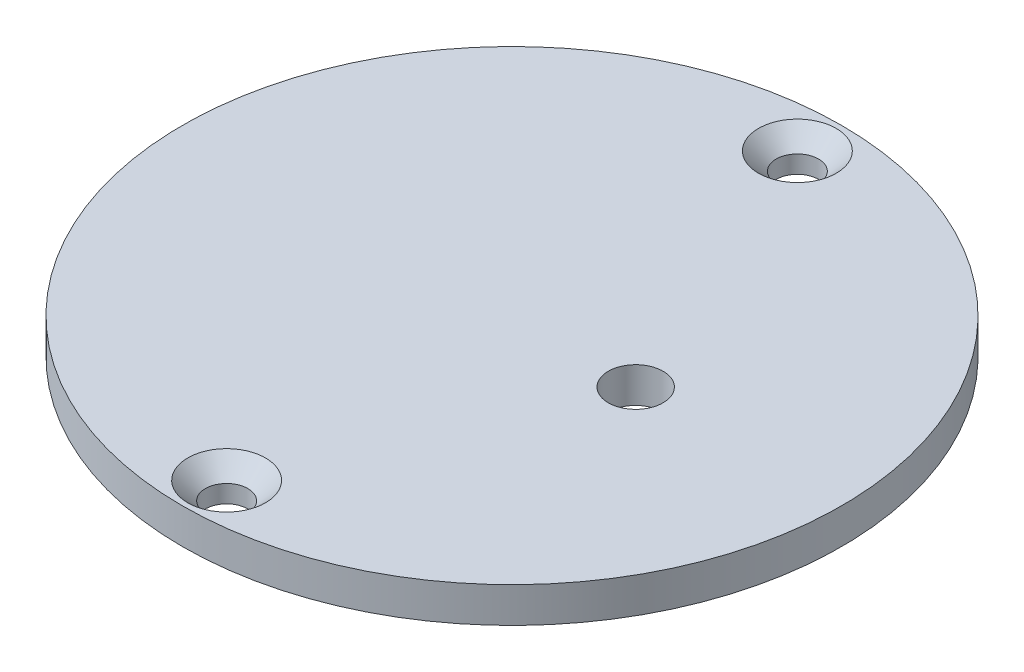
ISO-10303-21;
HEADER;
FILE_DESCRIPTION(('STEP AP214'),'2;1');
FILE_NAME('part.step','',(''),(''),'','','');
FILE_SCHEMA(('AUTOMOTIVE_DESIGN { 1 0 10303 214 1 1 1 1 }'));
ENDSEC;
DATA;
#1=APPLICATION_CONTEXT('core data for automotive mechanical design processes');
#2=APPLICATION_PROTOCOL_DEFINITION('international standard','automotive_design',2000,#1);
#3=PRODUCT_CONTEXT('',#1,'mechanical');
#4=PRODUCT('Part','Part','',(#3));
#5=PRODUCT_RELATED_PRODUCT_CATEGORY('part','',(#4));
#6=PRODUCT_DEFINITION_FORMATION('','',#4);
#7=PRODUCT_DEFINITION_CONTEXT('part definition',#1,'design');
#8=PRODUCT_DEFINITION('design','',#6,#7);
#9=PRODUCT_DEFINITION_SHAPE('','',#8);
#10=(LENGTH_UNIT() NAMED_UNIT(*) SI_UNIT(.MILLI.,.METRE.));
#11=(NAMED_UNIT(*) PLANE_ANGLE_UNIT() SI_UNIT($,.RADIAN.));
#12=(NAMED_UNIT(*) SI_UNIT($,.STERADIAN.) SOLID_ANGLE_UNIT());
#13=UNCERTAINTY_MEASURE_WITH_UNIT(LENGTH_MEASURE(1.E-05),#10,'distance_accuracy_value','');
#14=(GEOMETRIC_REPRESENTATION_CONTEXT(3) GLOBAL_UNCERTAINTY_ASSIGNED_CONTEXT((#13)) GLOBAL_UNIT_ASSIGNED_CONTEXT((#10,
#11,#12)) REPRESENTATION_CONTEXT('',''));
#15=CARTESIAN_POINT('',(0.,0.,0.));
#16=DIRECTION('',(0.,0.,1.));
#17=DIRECTION('',(1.,0.,0.));
#18=AXIS2_PLACEMENT_3D('',#15,#16,#17);
#19=CARTESIAN_POINT('',(0.,2.,0.));
#20=DIRECTION('',(0.,-1.,0.));
#21=DIRECTION('',(0.,0.,-1.));
#22=AXIS2_PLACEMENT_3D('',#19,#20,#21);
#23=CYLINDRICAL_SURFACE('',#22,18.65);
#24=CARTESIAN_POINT('',(0.,2.,0.));
#25=DIRECTION('',(0.,1.,0.));
#26=DIRECTION('',(0.,0.,1.));
#27=AXIS2_PLACEMENT_3D('',#24,#25,#26);
#28=CIRCLE('',#27,18.65);
#29=CARTESIAN_POINT('',(0.,2.,18.65));
#30=VERTEX_POINT('',#29);
#31=EDGE_CURVE('E10',#30,#30,#28,.T.);
#32=ORIENTED_EDGE('',*,*,#31,.F.);
#33=EDGE_LOOP('',(#32));
#34=FACE_BOUND('',#33,.T.);
#35=CARTESIAN_POINT('',(0.,0.,0.));
#36=DIRECTION('',(0.,1.,0.));
#37=DIRECTION('',(0.,0.,1.));
#38=AXIS2_PLACEMENT_3D('',#35,#36,#37);
#39=CIRCLE('',#38,18.65);
#40=CARTESIAN_POINT('',(0.,0.,18.65));
#41=VERTEX_POINT('',#40);
#42=EDGE_CURVE('E36',#41,#41,#39,.T.);
#43=ORIENTED_EDGE('',*,*,#42,.T.);
#44=EDGE_LOOP('',(#43));
#45=FACE_BOUND('',#44,.T.);
#46=ADVANCED_FACE('F33',(#34,#45),#23,.T.);
#47=CARTESIAN_POINT('',(0.,2.,0.));
#48=DIRECTION('',(0.,1.,0.));
#49=DIRECTION('',(0.,0.,1.));
#50=AXIS2_PLACEMENT_3D('',#47,#48,#49);
#51=PLANE('',#50);
#52=CARTESIAN_POINT('',(0.,2.,-16.15));
#53=DIRECTION('',(0.,1.,0.));
#54=DIRECTION('',(0.,0.,1.));
#55=AXIS2_PLACEMENT_3D('',#52,#53,#54);
#56=CIRCLE('',#55,2.2);
#57=CARTESIAN_POINT('',(0.,2.,-13.95));
#58=VERTEX_POINT('',#57);
#59=EDGE_CURVE('E65',#58,#58,#56,.T.);
#60=ORIENTED_EDGE('',*,*,#59,.F.);
#61=EDGE_LOOP('',(#60));
#62=FACE_BOUND('',#61,.T.);
#63=CARTESIAN_POINT('',(0.,2.,16.15));
#64=DIRECTION('',(0.,1.,0.));
#65=DIRECTION('',(0.,0.,1.));
#66=AXIS2_PLACEMENT_3D('',#63,#64,#65);
#67=CIRCLE('',#66,2.2);
#68=CARTESIAN_POINT('',(0.,2.,18.35));
#69=VERTEX_POINT('',#68);
#70=EDGE_CURVE('E56',#69,#69,#67,.T.);
#71=ORIENTED_EDGE('',*,*,#70,.F.);
#72=EDGE_LOOP('',(#71));
#73=FACE_BOUND('',#72,.T.);
#74=CARTESIAN_POINT('',(7.,2.,0.));
#75=DIRECTION('',(0.,1.,0.));
#76=DIRECTION('',(0.,0.,1.));
#77=AXIS2_PLACEMENT_3D('',#74,#75,#76);
#78=CIRCLE('',#77,1.55);
#79=CARTESIAN_POINT('',(7.,2.,1.55));
#80=VERTEX_POINT('',#79);
#81=EDGE_CURVE('E45',#80,#80,#78,.T.);
#82=ORIENTED_EDGE('',*,*,#81,.F.);
#83=EDGE_LOOP('',(#82));
#84=FACE_BOUND('',#83,.T.);
#85=ORIENTED_EDGE('',*,*,#31,.T.);
#86=EDGE_LOOP('',(#85));
#87=FACE_BOUND('',#86,.T.);
#88=ADVANCED_FACE('F71',(#62,#73,#84,#87),#51,.T.);
#89=CARTESIAN_POINT('',(0.,0.,0.));
#90=DIRECTION('',(0.,1.,0.));
#91=DIRECTION('',(0.,0.,1.));
#92=AXIS2_PLACEMENT_3D('',#89,#90,#91);
#93=PLANE('',#92);
#94=CARTESIAN_POINT('',(0.,0.,-16.15));
#95=DIRECTION('',(0.,1.,0.));
#96=DIRECTION('',(0.,0.,1.));
#97=AXIS2_PLACEMENT_3D('',#94,#95,#96);
#98=CIRCLE('',#97,1.2);
#99=CARTESIAN_POINT('',(0.,0.,-14.95));
#100=VERTEX_POINT('',#99);
#101=EDGE_CURVE('E59',#100,#100,#98,.T.);
#102=ORIENTED_EDGE('',*,*,#101,.T.);
#103=EDGE_LOOP('',(#102));
#104=FACE_BOUND('',#103,.T.);
#105=CARTESIAN_POINT('',(0.,0.,16.15));
#106=DIRECTION('',(0.,1.,0.));
#107=DIRECTION('',(0.,0.,1.));
#108=AXIS2_PLACEMENT_3D('',#105,#106,#107);
#109=CIRCLE('',#108,1.2);
#110=CARTESIAN_POINT('',(0.,0.,17.35));
#111=VERTEX_POINT('',#110);
#112=EDGE_CURVE('E48',#111,#111,#109,.T.);
#113=ORIENTED_EDGE('',*,*,#112,.T.);
#114=EDGE_LOOP('',(#113));
#115=FACE_BOUND('',#114,.T.);
#116=CARTESIAN_POINT('',(7.,0.,0.));
#117=DIRECTION('',(0.,1.,0.));
#118=DIRECTION('',(0.,0.,1.));
#119=AXIS2_PLACEMENT_3D('',#116,#117,#118);
#120=CIRCLE('',#119,1.55);
#121=CARTESIAN_POINT('',(7.,0.,1.55));
#122=VERTEX_POINT('',#121);
#123=EDGE_CURVE('E43',#122,#122,#120,.T.);
#124=ORIENTED_EDGE('',*,*,#123,.T.);
#125=EDGE_LOOP('',(#124));
#126=FACE_BOUND('',#125,.T.);
#127=ORIENTED_EDGE('',*,*,#42,.F.);
#128=EDGE_LOOP('',(#127));
#129=FACE_BOUND('',#128,.T.);
#130=ADVANCED_FACE('F74',(#104,#115,#126,#129),#93,.F.);
#131=CARTESIAN_POINT('',(7.,0.,0.));
#132=DIRECTION('',(0.,1.,0.));
#133=DIRECTION('',(0.,0.,1.));
#134=AXIS2_PLACEMENT_3D('',#131,#132,#133);
#135=CYLINDRICAL_SURFACE('',#134,1.55);
#136=ORIENTED_EDGE('',*,*,#123,.F.);
#137=EDGE_LOOP('',(#136));
#138=FACE_BOUND('',#137,.T.);
#139=ORIENTED_EDGE('',*,*,#81,.T.);
#140=EDGE_LOOP('',(#139));
#141=FACE_BOUND('',#140,.T.);
#142=ADVANCED_FACE('F80',(#138,#141),#135,.F.);
#143=CARTESIAN_POINT('',(0.,2.,16.15));
#144=DIRECTION('',(0.,1.,0.));
#145=DIRECTION('',(0.,0.,1.));
#146=AXIS2_PLACEMENT_3D('',#143,#144,#145);
#147=CYLINDRICAL_SURFACE('',#146,1.2);
#148=ORIENTED_EDGE('',*,*,#112,.F.);
#149=EDGE_LOOP('',(#148));
#150=FACE_BOUND('',#149,.T.);
#151=CARTESIAN_POINT('',(0.,0.999999999999999,16.15));
#152=DIRECTION('',(0.,1.,0.));
#153=DIRECTION('',(0.,0.,1.));
#154=AXIS2_PLACEMENT_3D('',#151,#152,#153);
#155=CIRCLE('',#154,1.2);
#156=CARTESIAN_POINT('',(0.,0.999999999999999,17.35));
#157=VERTEX_POINT('',#156);
#158=EDGE_CURVE('E53',#157,#157,#155,.T.);
#159=ORIENTED_EDGE('',*,*,#158,.T.);
#160=EDGE_LOOP('',(#159));
#161=FACE_BOUND('',#160,.T.);
#162=ADVANCED_FACE('F82',(#150,#161),#147,.F.);
#163=CARTESIAN_POINT('',(0.,2.,16.15));
#164=DIRECTION('',(0.,1.,0.));
#165=DIRECTION('',(0.,0.,1.));
#166=AXIS2_PLACEMENT_3D('',#163,#164,#165);
#167=CONICAL_SURFACE('',#166,2.2,0.785398163397448);
#168=ORIENTED_EDGE('',*,*,#158,.F.);
#169=EDGE_LOOP('',(#168));
#170=FACE_BOUND('',#169,.T.);
#171=ORIENTED_EDGE('',*,*,#70,.T.);
#172=EDGE_LOOP('',(#171));
#173=FACE_BOUND('',#172,.T.);
#174=ADVANCED_FACE('F89',(#170,#173),#167,.F.);
#175=CARTESIAN_POINT('',(0.,2.,-16.15));
#176=DIRECTION('',(0.,1.,0.));
#177=DIRECTION('',(0.,0.,1.));
#178=AXIS2_PLACEMENT_3D('',#175,#176,#177);
#179=CYLINDRICAL_SURFACE('',#178,1.2);
#180=ORIENTED_EDGE('',*,*,#101,.F.);
#181=EDGE_LOOP('',(#180));
#182=FACE_BOUND('',#181,.T.);
#183=CARTESIAN_POINT('',(0.,0.999999999999999,-16.15));
#184=DIRECTION('',(0.,1.,0.));
#185=DIRECTION('',(0.,0.,1.));
#186=AXIS2_PLACEMENT_3D('',#183,#184,#185);
#187=CIRCLE('',#186,1.2);
#188=CARTESIAN_POINT('',(0.,0.999999999999999,-14.95));
#189=VERTEX_POINT('',#188);
#190=EDGE_CURVE('E62',#189,#189,#187,.T.);
#191=ORIENTED_EDGE('',*,*,#190,.T.);
#192=EDGE_LOOP('',(#191));
#193=FACE_BOUND('',#192,.T.);
#194=ADVANCED_FACE('F127',(#182,#193),#179,.F.);
#195=CARTESIAN_POINT('',(0.,2.,-16.15));
#196=DIRECTION('',(0.,1.,0.));
#197=DIRECTION('',(0.,0.,1.));
#198=AXIS2_PLACEMENT_3D('',#195,#196,#197);
#199=CONICAL_SURFACE('',#198,2.2,0.785398163397448);
#200=ORIENTED_EDGE('',*,*,#190,.F.);
#201=EDGE_LOOP('',(#200));
#202=FACE_BOUND('',#201,.T.);
#203=ORIENTED_EDGE('',*,*,#59,.T.);
#204=EDGE_LOOP('',(#203));
#205=FACE_BOUND('',#204,.T.);
#206=ADVANCED_FACE('F69',(#202,#205),#199,.F.);
#207=CLOSED_SHELL('',(#46,#88,#130,#142,#162,#174,#194,#206));
#208=MANIFOLD_SOLID_BREP('B2',#207);
#209=ADVANCED_BREP_SHAPE_REPRESENTATION('',(#18,#208),#14);
#210=SHAPE_DEFINITION_REPRESENTATION(#9,#209);
ENDSEC;
END-ISO-10303-21;
